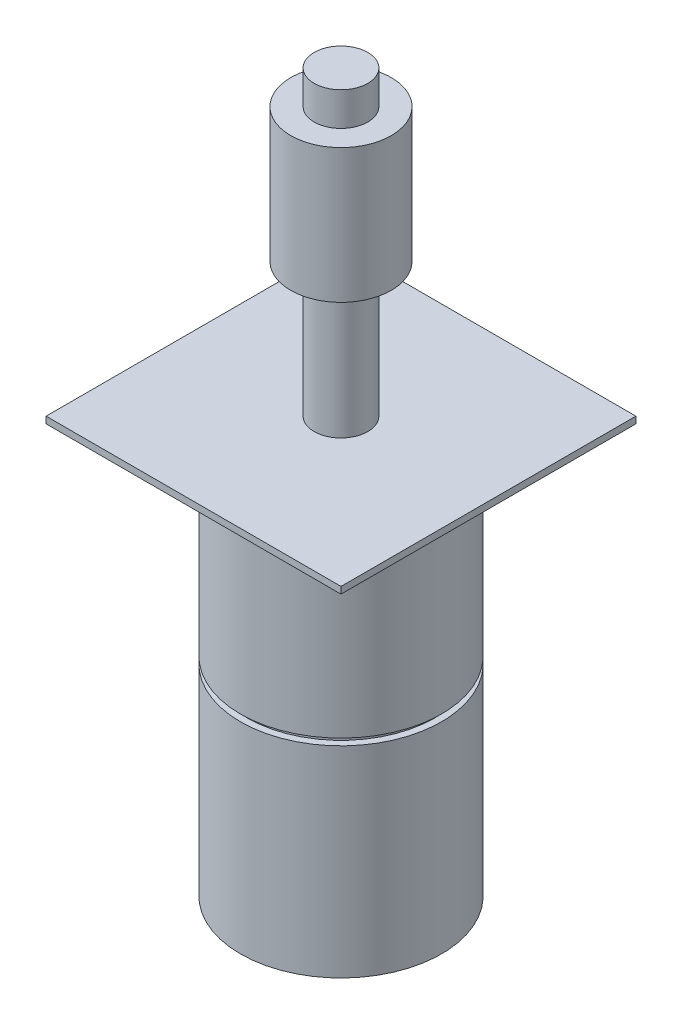
ISO-10303-21;
HEADER;
FILE_DESCRIPTION(('STEP AP214'),'2;1');
FILE_NAME('part.step','',(''),(''),'','','');
FILE_SCHEMA(('AUTOMOTIVE_DESIGN { 1 0 10303 214 1 1 1 1 }'));
ENDSEC;
DATA;
#1=APPLICATION_CONTEXT('core data for automotive mechanical design processes');
#2=APPLICATION_PROTOCOL_DEFINITION('international standard','automotive_design',2000,#1);
#3=PRODUCT_CONTEXT('',#1,'mechanical');
#4=PRODUCT('Part','Part','',(#3));
#5=PRODUCT_RELATED_PRODUCT_CATEGORY('part','',(#4));
#6=PRODUCT_DEFINITION_FORMATION('','',#4);
#7=PRODUCT_DEFINITION_CONTEXT('part definition',#1,'design');
#8=PRODUCT_DEFINITION('design','',#6,#7);
#9=PRODUCT_DEFINITION_SHAPE('','',#8);
#10=(LENGTH_UNIT() NAMED_UNIT(*) SI_UNIT(.MILLI.,.METRE.));
#11=(NAMED_UNIT(*) PLANE_ANGLE_UNIT() SI_UNIT($,.RADIAN.));
#12=(NAMED_UNIT(*) SI_UNIT($,.STERADIAN.) SOLID_ANGLE_UNIT());
#13=UNCERTAINTY_MEASURE_WITH_UNIT(LENGTH_MEASURE(1.E-05),#10,'distance_accuracy_value','');
#14=(GEOMETRIC_REPRESENTATION_CONTEXT(3) GLOBAL_UNCERTAINTY_ASSIGNED_CONTEXT((#13)) GLOBAL_UNIT_ASSIGNED_CONTEXT((#10,
#11,#12)) REPRESENTATION_CONTEXT('',''));
#15=CARTESIAN_POINT('',(0.,0.,0.));
#16=DIRECTION('',(0.,0.,1.));
#17=DIRECTION('',(1.,0.,0.));
#18=AXIS2_PLACEMENT_3D('',#15,#16,#17);
#19=CARTESIAN_POINT('',(0.,-31.,0.));
#20=DIRECTION('',(0.,-1.,0.));
#21=DIRECTION('',(0.,0.,-1.));
#22=AXIS2_PLACEMENT_3D('',#19,#20,#21);
#23=PLANE('',#22);
#24=CARTESIAN_POINT('',(0.,-31.,0.));
#25=DIRECTION('',(0.,-1.,0.));
#26=DIRECTION('',(0.,0.,-1.));
#27=AXIS2_PLACEMENT_3D('',#24,#25,#26);
#28=CIRCLE('',#27,15.);
#29=CARTESIAN_POINT('',(0.,-31.,-15.));
#30=VERTEX_POINT('',#29);
#31=EDGE_CURVE('E161',#30,#30,#28,.T.);
#32=ORIENTED_EDGE('',*,*,#31,.T.);
#33=EDGE_LOOP('',(#32));
#34=FACE_BOUND('',#33,.T.);
#35=CARTESIAN_POINT('',(0.,-31.,0.));
#36=DIRECTION('',(0.,-1.,0.));
#37=DIRECTION('',(0.,0.,-1.));
#38=AXIS2_PLACEMENT_3D('',#35,#36,#37);
#39=CIRCLE('',#38,4.);
#40=CARTESIAN_POINT('',(0.,-31.,-4.));
#41=VERTEX_POINT('',#40);
#42=EDGE_CURVE('E170',#41,#41,#39,.T.);
#43=ORIENTED_EDGE('',*,*,#42,.F.);
#44=EDGE_LOOP('',(#43));
#45=FACE_BOUND('',#44,.T.);
#46=ADVANCED_FACE('F33',(#34,#45),#23,.T.);
#47=CARTESIAN_POINT('',(0.,0.,0.));
#48=DIRECTION('',(0.,1.,0.));
#49=DIRECTION('',(0.,0.,1.));
#50=AXIS2_PLACEMENT_3D('',#47,#48,#49);
#51=PLANE('',#50);
#52=CARTESIAN_POINT('',(0.,0.,0.));
#53=DIRECTION('',(0.,1.,0.));
#54=DIRECTION('',(0.,0.,1.));
#55=AXIS2_PLACEMENT_3D('',#52,#53,#54);
#56=CIRCLE('',#55,15.);
#57=CARTESIAN_POINT('',(0.,0.,15.));
#58=VERTEX_POINT('',#57);
#59=EDGE_CURVE('E112',#58,#58,#56,.T.);
#60=ORIENTED_EDGE('',*,*,#59,.F.);
#61=EDGE_LOOP('',(#60));
#62=FACE_BOUND('',#61,.T.);
#63=CARTESIAN_POINT('',(0.,0.,0.));
#64=DIRECTION('',(0.,1.,0.));
#65=DIRECTION('',(0.,0.,1.));
#66=AXIS2_PLACEMENT_3D('',#63,#64,#65);
#67=CIRCLE('',#66,14.);
#68=CARTESIAN_POINT('',(0.,0.,14.));
#69=VERTEX_POINT('',#68);
#70=EDGE_CURVE('E11',#69,#69,#67,.F.);
#71=ORIENTED_EDGE('',*,*,#70,.F.);
#72=EDGE_LOOP('',(#71));
#73=FACE_BOUND('',#72,.T.);
#74=ADVANCED_FACE('F118',(#62,#73),#51,.F.);
#75=CARTESIAN_POINT('',(0.,71.,0.));
#76=DIRECTION('',(0.,1.,0.));
#77=DIRECTION('',(0.,0.,1.));
#78=AXIS2_PLACEMENT_3D('',#75,#76,#77);
#79=PLANE('',#78);
#80=CARTESIAN_POINT('',(0.,71.,0.));
#81=DIRECTION('',(0.,1.,0.));
#82=DIRECTION('',(0.,0.,1.));
#83=AXIS2_PLACEMENT_3D('',#80,#81,#82);
#84=CIRCLE('',#83,7.5);
#85=CARTESIAN_POINT('',(0.,71.,7.5));
#86=VERTEX_POINT('',#85);
#87=EDGE_CURVE('E183',#86,#86,#84,.T.);
#88=ORIENTED_EDGE('',*,*,#87,.T.);
#89=EDGE_LOOP('',(#88));
#90=FACE_BOUND('',#89,.T.);
#91=CARTESIAN_POINT('',(0.,71.,0.));
#92=DIRECTION('',(0.,1.,0.));
#93=DIRECTION('',(0.,0.,1.));
#94=AXIS2_PLACEMENT_3D('',#91,#92,#93);
#95=CIRCLE('',#94,4.);
#96=CARTESIAN_POINT('',(0.,71.,4.));
#97=VERTEX_POINT('',#96);
#98=EDGE_CURVE('E176',#97,#97,#95,.T.);
#99=ORIENTED_EDGE('',*,*,#98,.F.);
#100=EDGE_LOOP('',(#99));
#101=FACE_BOUND('',#100,.T.);
#102=ADVANCED_FACE('F121',(#90,#101),#79,.T.);
#103=CARTESIAN_POINT('',(0.,31.,0.));
#104=DIRECTION('',(0.,1.,0.));
#105=DIRECTION('',(0.,0.,1.));
#106=AXIS2_PLACEMENT_3D('',#103,#104,#105);
#107=PLANE('',#106);
#108=DIRECTION('',(0.,0.,-1.));
#109=VECTOR('',#108,1.);
#110=CARTESIAN_POINT('',(22.,31.,-22.));
#111=LINE('',#110,#109);
#112=CARTESIAN_POINT('',(22.,31.,22.));
#113=VERTEX_POINT('',#112);
#114=CARTESIAN_POINT('',(22.,31.,-22.));
#115=VERTEX_POINT('',#114);
#116=EDGE_CURVE('E87',#113,#115,#111,.T.);
#117=ORIENTED_EDGE('',*,*,#116,.T.);
#118=DIRECTION('',(-1.,0.,0.));
#119=VECTOR('',#118,1.);
#120=CARTESIAN_POINT('',(-22.,31.,-22.));
#121=LINE('',#120,#119);
#122=CARTESIAN_POINT('',(-22.,31.,-22.));
#123=VERTEX_POINT('',#122);
#124=EDGE_CURVE('E81',#115,#123,#121,.T.);
#125=ORIENTED_EDGE('',*,*,#124,.T.);
#126=DIRECTION('',(0.,0.,1.));
#127=VECTOR('',#126,1.);
#128=CARTESIAN_POINT('',(-22.,31.,-22.));
#129=LINE('',#128,#127);
#130=CARTESIAN_POINT('',(-22.,31.,22.));
#131=VERTEX_POINT('',#130);
#132=EDGE_CURVE('E85',#123,#131,#129,.T.);
#133=ORIENTED_EDGE('',*,*,#132,.T.);
#134=DIRECTION('',(1.,0.,0.));
#135=VECTOR('',#134,1.);
#136=CARTESIAN_POINT('',(-22.,31.,22.));
#137=LINE('',#136,#135);
#138=EDGE_CURVE('E50',#131,#113,#137,.T.);
#139=ORIENTED_EDGE('',*,*,#138,.T.);
#140=EDGE_LOOP('',(#117,#125,#133,#139));
#141=FACE_BOUND('',#140,.T.);
#142=CARTESIAN_POINT('',(0.,31.,0.));
#143=DIRECTION('',(0.,1.,0.));
#144=DIRECTION('',(0.,0.,1.));
#145=AXIS2_PLACEMENT_3D('',#142,#143,#144);
#146=CIRCLE('',#145,4.);
#147=CARTESIAN_POINT('',(0.,31.,4.));
#148=VERTEX_POINT('',#147);
#149=EDGE_CURVE('E186',#148,#148,#146,.T.);
#150=ORIENTED_EDGE('',*,*,#149,.F.);
#151=EDGE_LOOP('',(#150));
#152=FACE_BOUND('',#151,.T.);
#153=ADVANCED_FACE('F82',(#141,#152),#107,.T.);
#154=CARTESIAN_POINT('',(0.,30.,0.));
#155=DIRECTION('',(0.,-1.,0.));
#156=DIRECTION('',(0.,0.,-1.));
#157=AXIS2_PLACEMENT_3D('',#154,#155,#156);
#158=CYLINDRICAL_SURFACE('',#157,15.);
#159=CARTESIAN_POINT('',(0.,30.,0.));
#160=DIRECTION('',(0.,1.,0.));
#161=DIRECTION('',(0.,0.,1.));
#162=AXIS2_PLACEMENT_3D('',#159,#160,#161);
#163=CIRCLE('',#162,15.);
#164=CARTESIAN_POINT('',(0.,30.,15.));
#165=VERTEX_POINT('',#164);
#166=EDGE_CURVE('E42',#165,#165,#163,.T.);
#167=ORIENTED_EDGE('',*,*,#166,.F.);
#168=EDGE_LOOP('',(#167));
#169=FACE_BOUND('',#168,.T.);
#170=ORIENTED_EDGE('',*,*,#59,.T.);
#171=EDGE_LOOP('',(#170));
#172=FACE_BOUND('',#171,.T.);
#173=ADVANCED_FACE('F35',(#169,#172),#158,.T.);
#174=CARTESIAN_POINT('',(0.,30.,0.));
#175=DIRECTION('',(0.,1.,0.));
#176=DIRECTION('',(0.,0.,1.));
#177=AXIS2_PLACEMENT_3D('',#174,#175,#176);
#178=PLANE('',#177);
#179=DIRECTION('',(0.,0.,-1.));
#180=VECTOR('',#179,1.);
#181=CARTESIAN_POINT('',(22.,30.,-22.));
#182=LINE('',#181,#180);
#183=CARTESIAN_POINT('',(22.,30.,22.));
#184=VERTEX_POINT('',#183);
#185=CARTESIAN_POINT('',(22.,30.,-22.));
#186=VERTEX_POINT('',#185);
#187=EDGE_CURVE('E102',#184,#186,#182,.T.);
#188=ORIENTED_EDGE('',*,*,#187,.F.);
#189=DIRECTION('',(1.,0.,0.));
#190=VECTOR('',#189,1.);
#191=CARTESIAN_POINT('',(-22.,30.,22.));
#192=LINE('',#191,#190);
#193=CARTESIAN_POINT('',(-22.,30.,22.));
#194=VERTEX_POINT('',#193);
#195=EDGE_CURVE('E73',#194,#184,#192,.T.);
#196=ORIENTED_EDGE('',*,*,#195,.F.);
#197=DIRECTION('',(0.,0.,1.));
#198=VECTOR('',#197,1.);
#199=CARTESIAN_POINT('',(-22.,30.,-22.));
#200=LINE('',#199,#198);
#201=CARTESIAN_POINT('',(-22.,30.,-22.));
#202=VERTEX_POINT('',#201);
#203=EDGE_CURVE('E67',#202,#194,#200,.T.);
#204=ORIENTED_EDGE('',*,*,#203,.F.);
#205=DIRECTION('',(-1.,0.,0.));
#206=VECTOR('',#205,1.);
#207=CARTESIAN_POINT('',(-22.,30.,-22.));
#208=LINE('',#207,#206);
#209=EDGE_CURVE('E92',#186,#202,#208,.T.);
#210=ORIENTED_EDGE('',*,*,#209,.F.);
#211=EDGE_LOOP('',(#188,#196,#204,#210));
#212=FACE_BOUND('',#211,.T.);
#213=ORIENTED_EDGE('',*,*,#166,.T.);
#214=EDGE_LOOP('',(#213));
#215=FACE_BOUND('',#214,.T.);
#216=ADVANCED_FACE('F201',(#212,#215),#178,.F.);
#217=CARTESIAN_POINT('',(22.,31.,-22.));
#218=DIRECTION('',(-1.,0.,0.));
#219=DIRECTION('',(0.,0.,1.));
#220=AXIS2_PLACEMENT_3D('',#217,#218,#219);
#221=PLANE('',#220);
#222=ORIENTED_EDGE('',*,*,#187,.T.);
#223=DIRECTION('',(0.,-1.,0.));
#224=VECTOR('',#223,1.);
#225=CARTESIAN_POINT('',(22.,31.,-22.));
#226=LINE('',#225,#224);
#227=EDGE_CURVE('E93',#115,#186,#226,.T.);
#228=ORIENTED_EDGE('',*,*,#227,.F.);
#229=ORIENTED_EDGE('',*,*,#116,.F.);
#230=DIRECTION('',(0.,-1.,0.));
#231=VECTOR('',#230,1.);
#232=CARTESIAN_POINT('',(22.,31.,22.));
#233=LINE('',#232,#231);
#234=EDGE_CURVE('E98',#113,#184,#233,.T.);
#235=ORIENTED_EDGE('',*,*,#234,.T.);
#236=EDGE_LOOP('',(#222,#228,#229,#235));
#237=FACE_BOUND('',#236,.T.);
#238=ADVANCED_FACE('F210',(#237),#221,.F.);
#239=CARTESIAN_POINT('',(-22.,31.,-22.));
#240=DIRECTION('',(0.,0.,1.));
#241=DIRECTION('',(1.,0.,0.));
#242=AXIS2_PLACEMENT_3D('',#239,#240,#241);
#243=PLANE('',#242);
#244=ORIENTED_EDGE('',*,*,#209,.T.);
#245=DIRECTION('',(0.,-1.,0.));
#246=VECTOR('',#245,1.);
#247=CARTESIAN_POINT('',(-22.,31.,-22.));
#248=LINE('',#247,#246);
#249=EDGE_CURVE('E90',#123,#202,#248,.T.);
#250=ORIENTED_EDGE('',*,*,#249,.F.);
#251=ORIENTED_EDGE('',*,*,#124,.F.);
#252=ORIENTED_EDGE('',*,*,#227,.T.);
#253=EDGE_LOOP('',(#244,#250,#251,#252));
#254=FACE_BOUND('',#253,.T.);
#255=ADVANCED_FACE('F91',(#254),#243,.F.);
#256=CARTESIAN_POINT('',(-22.,31.,-22.));
#257=DIRECTION('',(1.,0.,0.));
#258=DIRECTION('',(0.,0.,-1.));
#259=AXIS2_PLACEMENT_3D('',#256,#257,#258);
#260=PLANE('',#259);
#261=ORIENTED_EDGE('',*,*,#203,.T.);
#262=DIRECTION('',(0.,-1.,0.));
#263=VECTOR('',#262,1.);
#264=CARTESIAN_POINT('',(-22.,31.,22.));
#265=LINE('',#264,#263);
#266=EDGE_CURVE('E94',#131,#194,#265,.T.);
#267=ORIENTED_EDGE('',*,*,#266,.F.);
#268=ORIENTED_EDGE('',*,*,#132,.F.);
#269=ORIENTED_EDGE('',*,*,#249,.T.);
#270=EDGE_LOOP('',(#261,#267,#268,#269));
#271=FACE_BOUND('',#270,.T.);
#272=ADVANCED_FACE('F96',(#271),#260,.F.);
#273=CARTESIAN_POINT('',(-22.,31.,22.));
#274=DIRECTION('',(0.,0.,-1.));
#275=DIRECTION('',(-1.,0.,0.));
#276=AXIS2_PLACEMENT_3D('',#273,#274,#275);
#277=PLANE('',#276);
#278=ORIENTED_EDGE('',*,*,#195,.T.);
#279=ORIENTED_EDGE('',*,*,#234,.F.);
#280=ORIENTED_EDGE('',*,*,#138,.F.);
#281=ORIENTED_EDGE('',*,*,#266,.T.);
#282=EDGE_LOOP('',(#278,#279,#280,#281));
#283=FACE_BOUND('',#282,.T.);
#284=ADVANCED_FACE('F212',(#283),#277,.F.);
#285=CARTESIAN_POINT('',(0.,51.,0.));
#286=DIRECTION('',(0.,-1.,0.));
#287=DIRECTION('',(0.,0.,-1.));
#288=AXIS2_PLACEMENT_3D('',#285,#286,#287);
#289=CYLINDRICAL_SURFACE('',#288,4.);
#290=CARTESIAN_POINT('',(0.,51.,0.));
#291=DIRECTION('',(0.,1.,0.));
#292=DIRECTION('',(0.,0.,1.));
#293=AXIS2_PLACEMENT_3D('',#290,#291,#292);
#294=CIRCLE('',#293,4.);
#295=CARTESIAN_POINT('',(0.,51.,4.));
#296=VERTEX_POINT('',#295);
#297=EDGE_CURVE('E105',#296,#296,#294,.T.);
#298=ORIENTED_EDGE('',*,*,#297,.F.);
#299=EDGE_LOOP('',(#298));
#300=FACE_BOUND('',#299,.T.);
#301=ORIENTED_EDGE('',*,*,#149,.T.);
#302=EDGE_LOOP('',(#301));
#303=FACE_BOUND('',#302,.T.);
#304=ADVANCED_FACE('F194',(#300,#303),#289,.T.);
#305=CARTESIAN_POINT('',(0.,51.,0.));
#306=DIRECTION('',(0.,1.,0.));
#307=DIRECTION('',(0.,0.,1.));
#308=AXIS2_PLACEMENT_3D('',#305,#306,#307);
#309=PLANE('',#308);
#310=CARTESIAN_POINT('',(0.,51.,0.));
#311=DIRECTION('',(0.,1.,0.));
#312=DIRECTION('',(0.,0.,1.));
#313=AXIS2_PLACEMENT_3D('',#310,#311,#312);
#314=CIRCLE('',#313,7.5);
#315=CARTESIAN_POINT('',(0.,51.,7.5));
#316=VERTEX_POINT('',#315);
#317=EDGE_CURVE('E180',#316,#316,#314,.T.);
#318=ORIENTED_EDGE('',*,*,#317,.F.);
#319=EDGE_LOOP('',(#318));
#320=FACE_BOUND('',#319,.T.);
#321=ORIENTED_EDGE('',*,*,#297,.T.);
#322=EDGE_LOOP('',(#321));
#323=FACE_BOUND('',#322,.T.);
#324=ADVANCED_FACE('F246',(#320,#323),#309,.F.);
#325=CARTESIAN_POINT('',(0.,71.,0.));
#326=DIRECTION('',(0.,-1.,0.));
#327=DIRECTION('',(0.,0.,-1.));
#328=AXIS2_PLACEMENT_3D('',#325,#326,#327);
#329=CYLINDRICAL_SURFACE('',#328,7.5);
#330=ORIENTED_EDGE('',*,*,#87,.F.);
#331=EDGE_LOOP('',(#330));
#332=FACE_BOUND('',#331,.T.);
#333=ORIENTED_EDGE('',*,*,#317,.T.);
#334=EDGE_LOOP('',(#333));
#335=FACE_BOUND('',#334,.T.);
#336=ADVANCED_FACE('F253',(#332,#335),#329,.T.);
#337=CARTESIAN_POINT('',(0.,76.,0.));
#338=DIRECTION('',(0.,-1.,0.));
#339=DIRECTION('',(0.,0.,-1.));
#340=AXIS2_PLACEMENT_3D('',#337,#338,#339);
#341=CYLINDRICAL_SURFACE('',#340,4.);
#342=CARTESIAN_POINT('',(0.,76.,0.));
#343=DIRECTION('',(0.,1.,0.));
#344=DIRECTION('',(0.,0.,1.));
#345=AXIS2_PLACEMENT_3D('',#342,#343,#344);
#346=CIRCLE('',#345,4.);
#347=CARTESIAN_POINT('',(0.,76.,4.));
#348=VERTEX_POINT('',#347);
#349=EDGE_CURVE('E177',#348,#348,#346,.T.);
#350=ORIENTED_EDGE('',*,*,#349,.F.);
#351=EDGE_LOOP('',(#350));
#352=FACE_BOUND('',#351,.T.);
#353=ORIENTED_EDGE('',*,*,#98,.T.);
#354=EDGE_LOOP('',(#353));
#355=FACE_BOUND('',#354,.T.);
#356=ADVANCED_FACE('F137',(#352,#355),#341,.T.);
#357=CARTESIAN_POINT('',(0.,76.,0.));
#358=DIRECTION('',(0.,1.,0.));
#359=DIRECTION('',(0.,0.,1.));
#360=AXIS2_PLACEMENT_3D('',#357,#358,#359);
#361=PLANE('',#360);
#362=ORIENTED_EDGE('',*,*,#349,.T.);
#363=EDGE_LOOP('',(#362));
#364=FACE_BOUND('',#363,.T.);
#365=ADVANCED_FACE('F127',(#364),#361,.T.);
#366=CARTESIAN_POINT('',(0.,-1.,0.));
#367=DIRECTION('',(0.,1.,0.));
#368=DIRECTION('',(0.,0.,1.));
#369=AXIS2_PLACEMENT_3D('',#366,#367,#368);
#370=CYLINDRICAL_SURFACE('',#369,14.);
#371=CARTESIAN_POINT('',(0.,-1.,0.));
#372=DIRECTION('',(0.,-1.,0.));
#373=DIRECTION('',(0.,0.,-1.));
#374=AXIS2_PLACEMENT_3D('',#371,#372,#373);
#375=CIRCLE('',#374,14.);
#376=CARTESIAN_POINT('',(0.,-1.,-14.));
#377=VERTEX_POINT('',#376);
#378=EDGE_CURVE('E167',#377,#377,#375,.T.);
#379=ORIENTED_EDGE('',*,*,#378,.F.);
#380=EDGE_LOOP('',(#379));
#381=FACE_BOUND('',#380,.T.);
#382=ORIENTED_EDGE('',*,*,#70,.T.);
#383=EDGE_LOOP('',(#382));
#384=FACE_BOUND('',#383,.T.);
#385=ADVANCED_FACE('F124',(#381,#384),#370,.T.);
#386=CARTESIAN_POINT('',(0.,-1.,0.));
#387=DIRECTION('',(0.,-1.,0.));
#388=DIRECTION('',(0.,0.,-1.));
#389=AXIS2_PLACEMENT_3D('',#386,#387,#388);
#390=PLANE('',#389);
#391=CARTESIAN_POINT('',(0.,-1.,0.));
#392=DIRECTION('',(0.,-1.,0.));
#393=DIRECTION('',(0.,0.,-1.));
#394=AXIS2_PLACEMENT_3D('',#391,#392,#393);
#395=CIRCLE('',#394,15.);
#396=CARTESIAN_POINT('',(0.,-1.,-15.));
#397=VERTEX_POINT('',#396);
#398=EDGE_CURVE('E164',#397,#397,#395,.T.);
#399=ORIENTED_EDGE('',*,*,#398,.F.);
#400=EDGE_LOOP('',(#399));
#401=FACE_BOUND('',#400,.T.);
#402=ORIENTED_EDGE('',*,*,#378,.T.);
#403=EDGE_LOOP('',(#402));
#404=FACE_BOUND('',#403,.T.);
#405=ADVANCED_FACE('F126',(#401,#404),#390,.F.);
#406=CARTESIAN_POINT('',(0.,-31.,0.));
#407=DIRECTION('',(0.,1.,0.));
#408=DIRECTION('',(0.,0.,1.));
#409=AXIS2_PLACEMENT_3D('',#406,#407,#408);
#410=CYLINDRICAL_SURFACE('',#409,15.);
#411=ORIENTED_EDGE('',*,*,#31,.F.);
#412=EDGE_LOOP('',(#411));
#413=FACE_BOUND('',#412,.T.);
#414=ORIENTED_EDGE('',*,*,#398,.T.);
#415=EDGE_LOOP('',(#414));
#416=FACE_BOUND('',#415,.T.);
#417=ADVANCED_FACE('F134',(#413,#416),#410,.T.);
#418=CARTESIAN_POINT('',(0.,-36.,0.));
#419=DIRECTION('',(0.,1.,0.));
#420=DIRECTION('',(0.,0.,1.));
#421=AXIS2_PLACEMENT_3D('',#418,#419,#420);
#422=CYLINDRICAL_SURFACE('',#421,4.);
#423=CARTESIAN_POINT('',(0.,-36.,0.));
#424=DIRECTION('',(0.,-1.,0.));
#425=DIRECTION('',(0.,0.,-1.));
#426=AXIS2_PLACEMENT_3D('',#423,#424,#425);
#427=CIRCLE('',#426,4.);
#428=CARTESIAN_POINT('',(0.,-36.,-4.));
#429=VERTEX_POINT('',#428);
#430=EDGE_CURVE('E165',#429,#429,#427,.T.);
#431=ORIENTED_EDGE('',*,*,#430,.F.);
#432=EDGE_LOOP('',(#431));
#433=FACE_BOUND('',#432,.T.);
#434=ORIENTED_EDGE('',*,*,#42,.T.);
#435=EDGE_LOOP('',(#434));
#436=FACE_BOUND('',#435,.T.);
#437=ADVANCED_FACE('F150',(#433,#436),#422,.T.);
#438=CARTESIAN_POINT('',(0.,-36.,0.));
#439=DIRECTION('',(0.,-1.,0.));
#440=DIRECTION('',(0.,0.,-1.));
#441=AXIS2_PLACEMENT_3D('',#438,#439,#440);
#442=PLANE('',#441);
#443=ORIENTED_EDGE('',*,*,#430,.T.);
#444=EDGE_LOOP('',(#443));
#445=FACE_BOUND('',#444,.T.);
#446=ADVANCED_FACE('F157',(#445),#442,.T.);
#447=CLOSED_SHELL('',(#46,#74,#102,#153,#173,#216,#238,#255,#272,#284,#304,#324,#336,#356,#365,
#385,#405,#417,#437,#446));
#448=MANIFOLD_SOLID_BREP('B2',#447);
#449=ADVANCED_BREP_SHAPE_REPRESENTATION('',(#18,#448),#14);
#450=SHAPE_DEFINITION_REPRESENTATION(#9,#449);
ENDSEC;
END-ISO-10303-21;
